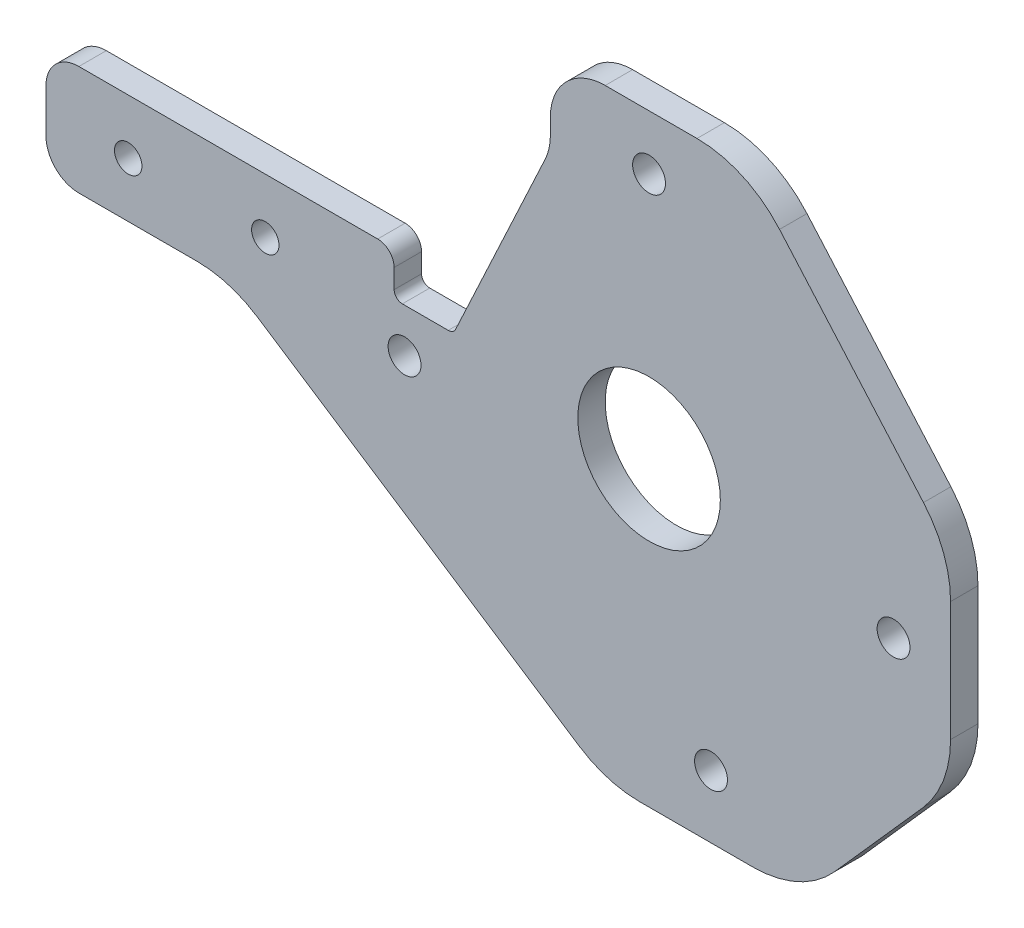
ISO-10303-21;
HEADER;
FILE_DESCRIPTION(('STEP AP214'),'2;1');
FILE_NAME('part.step','',(''),(''),'','','');
FILE_SCHEMA(('AUTOMOTIVE_DESIGN { 1 0 10303 214 1 1 1 1 }'));
ENDSEC;
DATA;
#1=APPLICATION_CONTEXT('core data for automotive mechanical design processes');
#2=APPLICATION_PROTOCOL_DEFINITION('international standard','automotive_design',2000,#1);
#3=PRODUCT_CONTEXT('',#1,'mechanical');
#4=PRODUCT('Part','Part','',(#3));
#5=PRODUCT_RELATED_PRODUCT_CATEGORY('part','',(#4));
#6=PRODUCT_DEFINITION_FORMATION('','',#4);
#7=PRODUCT_DEFINITION_CONTEXT('part definition',#1,'design');
#8=PRODUCT_DEFINITION('design','',#6,#7);
#9=PRODUCT_DEFINITION_SHAPE('','',#8);
#10=(LENGTH_UNIT() NAMED_UNIT(*) SI_UNIT(.MILLI.,.METRE.));
#11=(NAMED_UNIT(*) PLANE_ANGLE_UNIT() SI_UNIT($,.RADIAN.));
#12=(NAMED_UNIT(*) SI_UNIT($,.STERADIAN.) SOLID_ANGLE_UNIT());
#13=UNCERTAINTY_MEASURE_WITH_UNIT(LENGTH_MEASURE(1.E-05),#10,'distance_accuracy_value','');
#14=(GEOMETRIC_REPRESENTATION_CONTEXT(3) GLOBAL_UNCERTAINTY_ASSIGNED_CONTEXT((#13)) GLOBAL_UNIT_ASSIGNED_CONTEXT((#10,
#11,#12)) REPRESENTATION_CONTEXT('',''));
#15=CARTESIAN_POINT('',(0.,0.,0.));
#16=DIRECTION('',(0.,0.,1.));
#17=DIRECTION('',(1.,0.,0.));
#18=AXIS2_PLACEMENT_3D('',#15,#16,#17);
#19=CARTESIAN_POINT('',(0.,-10.,2.5));
#20=DIRECTION('',(0.,1.,0.));
#21=DIRECTION('',(0.,0.,1.));
#22=AXIS2_PLACEMENT_3D('',#19,#20,#21);
#23=PLANE('',#22);
#24=DIRECTION('',(1.,0.,0.));
#25=VECTOR('',#24,1.);
#26=CARTESIAN_POINT('',(0.,-10.,2.5));
#27=LINE('',#26,#25);
#28=CARTESIAN_POINT('',(-104.,-10.,2.5));
#29=VERTEX_POINT('',#28);
#30=CARTESIAN_POINT('',(-82.4582213056563,-10.,2.5));
#31=VERTEX_POINT('',#30);
#32=EDGE_CURVE('E301',#29,#31,#27,.T.);
#33=ORIENTED_EDGE('',*,*,#32,.F.);
#34=DIRECTION('',(0.,0.,-1.));
#35=VECTOR('',#34,1.);
#36=CARTESIAN_POINT('',(-104.,-10.,2.5));
#37=LINE('',#36,#35);
#38=CARTESIAN_POINT('',(-104.,-10.,-2.5));
#39=VERTEX_POINT('',#38);
#40=EDGE_CURVE('E407',#29,#39,#37,.T.);
#41=ORIENTED_EDGE('',*,*,#40,.T.);
#42=DIRECTION('',(1.,0.,0.));
#43=VECTOR('',#42,1.);
#44=CARTESIAN_POINT('',(0.,-10.,-2.5));
#45=LINE('',#44,#43);
#46=CARTESIAN_POINT('',(-82.4582213056563,-10.,-2.5));
#47=VERTEX_POINT('',#46);
#48=EDGE_CURVE('E334',#39,#47,#45,.T.);
#49=ORIENTED_EDGE('',*,*,#48,.T.);
#50=DIRECTION('',(0.,0.,-1.));
#51=VECTOR('',#50,1.);
#52=CARTESIAN_POINT('',(-82.4582213056563,-10.,2.5));
#53=LINE('',#52,#51);
#54=EDGE_CURVE('E344',#47,#31,#53,.F.);
#55=ORIENTED_EDGE('',*,*,#54,.T.);
#56=EDGE_LOOP('',(#33,#41,#49,#55));
#57=FACE_BOUND('',#56,.T.);
#58=ADVANCED_FACE('F43',(#57),#23,.F.);
#59=CARTESIAN_POINT('',(0.,10.,2.5));
#60=DIRECTION('',(0.,-1.,0.));
#61=DIRECTION('',(1.,0.,0.));
#62=AXIS2_PLACEMENT_3D('',#59,#60,#61);
#63=PLANE('',#62);
#64=DIRECTION('',(-1.,0.,0.));
#65=VECTOR('',#64,1.);
#66=CARTESIAN_POINT('',(0.,10.,2.5));
#67=LINE('',#66,#65);
#68=CARTESIAN_POINT('',(-49.5,10.,2.5));
#69=VERTEX_POINT('',#68);
#70=CARTESIAN_POINT('',(-104.,9.99999999999999,2.5));
#71=VERTEX_POINT('',#70);
#72=EDGE_CURVE('E296',#69,#71,#67,.T.);
#73=ORIENTED_EDGE('',*,*,#72,.F.);
#74=DIRECTION('',(0.,0.,1.));
#75=VECTOR('',#74,1.);
#76=CARTESIAN_POINT('',(-49.5,10.,2.5));
#77=LINE('',#76,#75);
#78=CARTESIAN_POINT('',(-49.5,10.,-2.5));
#79=VERTEX_POINT('',#78);
#80=EDGE_CURVE('E435',#69,#79,#77,.F.);
#81=ORIENTED_EDGE('',*,*,#80,.T.);
#82=DIRECTION('',(-1.,0.,0.));
#83=VECTOR('',#82,1.);
#84=CARTESIAN_POINT('',(0.,10.,-2.5));
#85=LINE('',#84,#83);
#86=CARTESIAN_POINT('',(-104.,9.99999999999999,-2.5));
#87=VERTEX_POINT('',#86);
#88=EDGE_CURVE('E329',#79,#87,#85,.T.);
#89=ORIENTED_EDGE('',*,*,#88,.T.);
#90=DIRECTION('',(0.,0.,-1.));
#91=VECTOR('',#90,1.);
#92=CARTESIAN_POINT('',(-104.,9.99999999999999,2.5));
#93=LINE('',#92,#91);
#94=EDGE_CURVE('E400',#87,#71,#93,.F.);
#95=ORIENTED_EDGE('',*,*,#94,.T.);
#96=EDGE_LOOP('',(#73,#81,#89,#95));
#97=FACE_BOUND('',#96,.T.);
#98=ADVANCED_FACE('F480',(#97),#63,.F.);
#99=CARTESIAN_POINT('',(-110.,0.,2.5));
#100=DIRECTION('',(1.,0.,0.));
#101=DIRECTION('',(0.,1.,0.));
#102=AXIS2_PLACEMENT_3D('',#99,#100,#101);
#103=PLANE('',#102);
#104=DIRECTION('',(0.,-1.,0.));
#105=VECTOR('',#104,1.);
#106=CARTESIAN_POINT('',(-110.,0.,2.5));
#107=LINE('',#106,#105);
#108=CARTESIAN_POINT('',(-110.,3.99999999999999,2.5));
#109=VERTEX_POINT('',#108);
#110=CARTESIAN_POINT('',(-110.,-4.00000000000001,2.5));
#111=VERTEX_POINT('',#110);
#112=EDGE_CURVE('E298',#109,#111,#107,.T.);
#113=ORIENTED_EDGE('',*,*,#112,.F.);
#114=DIRECTION('',(0.,0.,-1.));
#115=VECTOR('',#114,1.);
#116=CARTESIAN_POINT('',(-110.,3.99999999999999,2.5));
#117=LINE('',#116,#115);
#118=CARTESIAN_POINT('',(-110.,3.99999999999999,-2.5));
#119=VERTEX_POINT('',#118);
#120=EDGE_CURVE('E392',#109,#119,#117,.T.);
#121=ORIENTED_EDGE('',*,*,#120,.T.);
#122=DIRECTION('',(0.,-1.,0.));
#123=VECTOR('',#122,1.);
#124=CARTESIAN_POINT('',(-110.,0.,-2.5));
#125=LINE('',#124,#123);
#126=CARTESIAN_POINT('',(-110.,-4.00000000000001,-2.5));
#127=VERTEX_POINT('',#126);
#128=EDGE_CURVE('E331',#119,#127,#125,.T.);
#129=ORIENTED_EDGE('',*,*,#128,.T.);
#130=DIRECTION('',(0.,0.,-1.));
#131=VECTOR('',#130,1.);
#132=CARTESIAN_POINT('',(-110.,-4.00000000000001,2.5));
#133=LINE('',#132,#131);
#134=EDGE_CURVE('E390',#127,#111,#133,.F.);
#135=ORIENTED_EDGE('',*,*,#134,.T.);
#136=EDGE_LOOP('',(#113,#121,#129,#135));
#137=FACE_BOUND('',#136,.T.);
#138=ADVANCED_FACE('F489',(#137),#103,.F.);
#139=CARTESIAN_POINT('',(0.,-55.,2.5));
#140=DIRECTION('',(0.,1.,0.));
#141=DIRECTION('',(0.,0.,1.));
#142=AXIS2_PLACEMENT_3D('',#139,#140,#141);
#143=PLANE('',#142);
#144=DIRECTION('',(1.,0.,0.));
#145=VECTOR('',#144,1.);
#146=CARTESIAN_POINT('',(0.,-55.,2.5));
#147=LINE('',#146,#145);
#148=CARTESIAN_POINT('',(-1.77605476291935,-55.,2.5));
#149=VERTEX_POINT('',#148);
#150=CARTESIAN_POINT('',(18.8874431024964,-55.,2.5));
#151=VERTEX_POINT('',#150);
#152=EDGE_CURVE('E303',#149,#151,#147,.T.);
#153=ORIENTED_EDGE('',*,*,#152,.F.);
#154=DIRECTION('',(0.,0.,1.));
#155=VECTOR('',#154,1.);
#156=CARTESIAN_POINT('',(-1.77605476291935,-55.,2.5));
#157=LINE('',#156,#155);
#158=CARTESIAN_POINT('',(-1.77605476291935,-55.,-2.5));
#159=VERTEX_POINT('',#158);
#160=EDGE_CURVE('E221',#149,#159,#157,.F.);
#161=ORIENTED_EDGE('',*,*,#160,.T.);
#162=DIRECTION('',(1.,0.,0.));
#163=VECTOR('',#162,1.);
#164=CARTESIAN_POINT('',(0.,-55.,-2.5));
#165=LINE('',#164,#163);
#166=CARTESIAN_POINT('',(18.8874431024964,-55.,-2.5));
#167=VERTEX_POINT('',#166);
#168=EDGE_CURVE('E336',#159,#167,#165,.T.);
#169=ORIENTED_EDGE('',*,*,#168,.T.);
#170=DIRECTION('',(0.,0.,1.));
#171=VECTOR('',#170,1.);
#172=CARTESIAN_POINT('',(18.8874431024964,-55.,2.5));
#173=LINE('',#172,#171);
#174=EDGE_CURVE('E225',#167,#151,#173,.T.);
#175=ORIENTED_EDGE('',*,*,#174,.T.);
#176=EDGE_LOOP('',(#153,#161,#169,#175));
#177=FACE_BOUND('',#176,.T.);
#178=ADVANCED_FACE('F505',(#177),#143,.F.);
#179=CARTESIAN_POINT('',(55.,0.,2.5));
#180=DIRECTION('',(-1.,0.,0.));
#181=DIRECTION('',(0.,0.,1.));
#182=AXIS2_PLACEMENT_3D('',#179,#180,#181);
#183=PLANE('',#182);
#184=DIRECTION('',(0.,1.,0.));
#185=VECTOR('',#184,1.);
#186=CARTESIAN_POINT('',(55.,0.,2.5));
#187=LINE('',#186,#185);
#188=CARTESIAN_POINT('',(55.,-16.8261267667128,2.5));
#189=VERTEX_POINT('',#188);
#190=CARTESIAN_POINT('',(55.,4.97596875721935,2.5));
#191=VERTEX_POINT('',#190);
#192=EDGE_CURVE('E305',#189,#191,#187,.T.);
#193=ORIENTED_EDGE('',*,*,#192,.F.);
#194=DIRECTION('',(0.,0.,1.));
#195=VECTOR('',#194,1.);
#196=CARTESIAN_POINT('',(55.,-16.8261267667128,2.5));
#197=LINE('',#196,#195);
#198=CARTESIAN_POINT('',(55.,-16.8261267667128,-2.5));
#199=VERTEX_POINT('',#198);
#200=EDGE_CURVE('E376',#189,#199,#197,.F.);
#201=ORIENTED_EDGE('',*,*,#200,.T.);
#202=DIRECTION('',(0.,1.,0.));
#203=VECTOR('',#202,1.);
#204=CARTESIAN_POINT('',(55.,0.,-2.5));
#205=LINE('',#204,#203);
#206=CARTESIAN_POINT('',(55.,4.97596875721935,-2.5));
#207=VERTEX_POINT('',#206);
#208=EDGE_CURVE('E339',#199,#207,#205,.T.);
#209=ORIENTED_EDGE('',*,*,#208,.T.);
#210=DIRECTION('',(0.,0.,1.));
#211=VECTOR('',#210,1.);
#212=CARTESIAN_POINT('',(55.,4.97596875721935,2.5));
#213=LINE('',#212,#211);
#214=EDGE_CURVE('E373',#207,#191,#213,.T.);
#215=ORIENTED_EDGE('',*,*,#214,.T.);
#216=EDGE_LOOP('',(#193,#201,#209,#215));
#217=FACE_BOUND('',#216,.T.);
#218=ADVANCED_FACE('F534',(#217),#183,.F.);
#219=CARTESIAN_POINT('',(0.,44.9999999999999,2.5));
#220=DIRECTION('',(0.,0.,-1.));
#221=DIRECTION('',(-1.,0.,0.));
#222=AXIS2_PLACEMENT_3D('',#219,#220,#221);
#223=CYLINDRICAL_SURFACE('',#222,3.00000000000001);
#224=CARTESIAN_POINT('',(0.,44.9999999999999,2.5));
#225=DIRECTION('',(0.,0.,1.));
#226=DIRECTION('',(1.,0.,0.));
#227=AXIS2_PLACEMENT_3D('',#224,#225,#226);
#228=CIRCLE('',#227,3.00000000000001);
#229=CARTESIAN_POINT('',(3.00000000000001,44.9999999999999,2.5));
#230=VERTEX_POINT('',#229);
#231=EDGE_CURVE('E293',#230,#230,#228,.T.);
#232=ORIENTED_EDGE('',*,*,#231,.T.);
#233=EDGE_LOOP('',(#232));
#234=FACE_BOUND('',#233,.T.);
#235=CARTESIAN_POINT('',(0.,44.9999999999999,-2.5));
#236=DIRECTION('',(0.,0.,1.));
#237=DIRECTION('',(1.,0.,0.));
#238=AXIS2_PLACEMENT_3D('',#235,#236,#237);
#239=CIRCLE('',#238,3.00000000000001);
#240=CARTESIAN_POINT('',(3.00000000000001,44.9999999999999,-2.5));
#241=VERTEX_POINT('',#240);
#242=EDGE_CURVE('E326',#241,#241,#239,.T.);
#243=ORIENTED_EDGE('',*,*,#242,.F.);
#244=EDGE_LOOP('',(#243));
#245=FACE_BOUND('',#244,.T.);
#246=ADVANCED_FACE('F559',(#234,#245),#223,.F.);
#247=CARTESIAN_POINT('',(-44.5982062419555,-6.00000000000005,2.5));
#248=DIRECTION('',(0.,0.,-1.));
#249=DIRECTION('',(-1.,0.,0.));
#250=AXIS2_PLACEMENT_3D('',#247,#248,#249);
#251=CYLINDRICAL_SURFACE('',#250,2.99999999999999);
#252=CARTESIAN_POINT('',(-44.5982062419555,-6.00000000000005,2.5));
#253=DIRECTION('',(0.,0.,1.));
#254=DIRECTION('',(1.,0.,0.));
#255=AXIS2_PLACEMENT_3D('',#252,#253,#254);
#256=CIRCLE('',#255,2.99999999999999);
#257=CARTESIAN_POINT('',(-41.5982062419555,-6.00000000000005,2.5));
#258=VERTEX_POINT('',#257);
#259=EDGE_CURVE('E290',#258,#258,#256,.T.);
#260=ORIENTED_EDGE('',*,*,#259,.T.);
#261=EDGE_LOOP('',(#260));
#262=FACE_BOUND('',#261,.T.);
#263=CARTESIAN_POINT('',(-44.5982062419555,-6.00000000000005,-2.5));
#264=DIRECTION('',(0.,0.,1.));
#265=DIRECTION('',(1.,0.,0.));
#266=AXIS2_PLACEMENT_3D('',#263,#264,#265);
#267=CIRCLE('',#266,2.99999999999999);
#268=CARTESIAN_POINT('',(-41.5982062419555,-6.00000000000005,-2.5));
#269=VERTEX_POINT('',#268);
#270=EDGE_CURVE('E323',#269,#269,#267,.T.);
#271=ORIENTED_EDGE('',*,*,#270,.F.);
#272=EDGE_LOOP('',(#271));
#273=FACE_BOUND('',#272,.T.);
#274=ADVANCED_FACE('F562',(#262,#273),#251,.F.);
#275=CARTESIAN_POINT('',(44.5982062419555,-6.00000000000005,2.5));
#276=DIRECTION('',(0.,0.,-1.));
#277=DIRECTION('',(-1.,0.,0.));
#278=AXIS2_PLACEMENT_3D('',#275,#276,#277);
#279=CYLINDRICAL_SURFACE('',#278,3.);
#280=CARTESIAN_POINT('',(44.5982062419555,-6.00000000000005,2.5));
#281=DIRECTION('',(0.,0.,1.));
#282=DIRECTION('',(1.,0.,0.));
#283=AXIS2_PLACEMENT_3D('',#280,#281,#282);
#284=CIRCLE('',#283,3.);
#285=CARTESIAN_POINT('',(47.5982062419555,-6.00000000000005,2.5));
#286=VERTEX_POINT('',#285);
#287=EDGE_CURVE('E287',#286,#286,#284,.T.);
#288=ORIENTED_EDGE('',*,*,#287,.T.);
#289=EDGE_LOOP('',(#288));
#290=FACE_BOUND('',#289,.T.);
#291=CARTESIAN_POINT('',(44.5982062419555,-6.00000000000005,-2.5));
#292=DIRECTION('',(0.,0.,1.));
#293=DIRECTION('',(1.,0.,0.));
#294=AXIS2_PLACEMENT_3D('',#291,#292,#293);
#295=CIRCLE('',#294,3.);
#296=CARTESIAN_POINT('',(47.5982062419555,-6.00000000000005,-2.5));
#297=VERTEX_POINT('',#296);
#298=EDGE_CURVE('E320',#297,#297,#295,.T.);
#299=ORIENTED_EDGE('',*,*,#298,.F.);
#300=EDGE_LOOP('',(#299));
#301=FACE_BOUND('',#300,.T.);
#302=ADVANCED_FACE('F566',(#290,#301),#279,.F.);
#303=CARTESIAN_POINT('',(11.3,-43.5581220899157,2.5));
#304=DIRECTION('',(0.,0.,-1.));
#305=DIRECTION('',(-1.,0.,0.));
#306=AXIS2_PLACEMENT_3D('',#303,#304,#305);
#307=CYLINDRICAL_SURFACE('',#306,3.00000000000001);
#308=CARTESIAN_POINT('',(11.3,-43.5581220899157,2.5));
#309=DIRECTION('',(0.,0.,1.));
#310=DIRECTION('',(1.,0.,0.));
#311=AXIS2_PLACEMENT_3D('',#308,#309,#310);
#312=CIRCLE('',#311,3.00000000000001);
#313=CARTESIAN_POINT('',(14.3,-43.5581220899157,2.5));
#314=VERTEX_POINT('',#313);
#315=EDGE_CURVE('E284',#314,#314,#312,.T.);
#316=ORIENTED_EDGE('',*,*,#315,.T.);
#317=EDGE_LOOP('',(#316));
#318=FACE_BOUND('',#317,.T.);
#319=CARTESIAN_POINT('',(11.3,-43.5581220899157,-2.5));
#320=DIRECTION('',(0.,0.,1.));
#321=DIRECTION('',(1.,0.,0.));
#322=AXIS2_PLACEMENT_3D('',#319,#320,#321);
#323=CIRCLE('',#322,3.00000000000001);
#324=CARTESIAN_POINT('',(14.3,-43.5581220899157,-2.5));
#325=VERTEX_POINT('',#324);
#326=EDGE_CURVE('E317',#325,#325,#323,.T.);
#327=ORIENTED_EDGE('',*,*,#326,.F.);
#328=EDGE_LOOP('',(#327));
#329=FACE_BOUND('',#328,.T.);
#330=ADVANCED_FACE('F570',(#318,#329),#307,.F.);
#331=CARTESIAN_POINT('',(0.,0.,2.5));
#332=DIRECTION('',(0.,0.,-1.));
#333=DIRECTION('',(-1.,0.,0.));
#334=AXIS2_PLACEMENT_3D('',#331,#332,#333);
#335=CYLINDRICAL_SURFACE('',#334,13.);
#336=CARTESIAN_POINT('',(0.,0.,2.5));
#337=DIRECTION('',(0.,0.,1.));
#338=DIRECTION('',(1.,0.,0.));
#339=AXIS2_PLACEMENT_3D('',#336,#337,#338);
#340=CIRCLE('',#339,13.);
#341=CARTESIAN_POINT('',(13.,0.,2.5));
#342=VERTEX_POINT('',#341);
#343=EDGE_CURVE('E281',#342,#342,#340,.T.);
#344=ORIENTED_EDGE('',*,*,#343,.T.);
#345=EDGE_LOOP('',(#344));
#346=FACE_BOUND('',#345,.T.);
#347=CARTESIAN_POINT('',(0.,0.,-2.5));
#348=DIRECTION('',(0.,0.,1.));
#349=DIRECTION('',(1.,0.,0.));
#350=AXIS2_PLACEMENT_3D('',#347,#348,#349);
#351=CIRCLE('',#350,13.);
#352=CARTESIAN_POINT('',(13.,0.,-2.5));
#353=VERTEX_POINT('',#352);
#354=EDGE_CURVE('E314',#353,#353,#351,.T.);
#355=ORIENTED_EDGE('',*,*,#354,.F.);
#356=EDGE_LOOP('',(#355));
#357=FACE_BOUND('',#356,.T.);
#358=ADVANCED_FACE('F574',(#346,#357),#335,.F.);
#359=CARTESIAN_POINT('',(-95.,0.,2.5));
#360=DIRECTION('',(0.,0.,-1.));
#361=DIRECTION('',(-1.,0.,0.));
#362=AXIS2_PLACEMENT_3D('',#359,#360,#361);
#363=CYLINDRICAL_SURFACE('',#362,2.50000000000001);
#364=CARTESIAN_POINT('',(-95.,0.,2.5));
#365=DIRECTION('',(0.,0.,1.));
#366=DIRECTION('',(1.,0.,0.));
#367=AXIS2_PLACEMENT_3D('',#364,#365,#366);
#368=CIRCLE('',#367,2.50000000000001);
#369=CARTESIAN_POINT('',(-92.5,0.,2.5));
#370=VERTEX_POINT('',#369);
#371=EDGE_CURVE('E277',#370,#370,#368,.T.);
#372=ORIENTED_EDGE('',*,*,#371,.T.);
#373=EDGE_LOOP('',(#372));
#374=FACE_BOUND('',#373,.T.);
#375=CARTESIAN_POINT('',(-95.,0.,-2.5));
#376=DIRECTION('',(0.,0.,1.));
#377=DIRECTION('',(1.,0.,0.));
#378=AXIS2_PLACEMENT_3D('',#375,#376,#377);
#379=CIRCLE('',#378,2.50000000000001);
#380=CARTESIAN_POINT('',(-92.5,0.,-2.5));
#381=VERTEX_POINT('',#380);
#382=EDGE_CURVE('E311',#381,#381,#379,.T.);
#383=ORIENTED_EDGE('',*,*,#382,.F.);
#384=EDGE_LOOP('',(#383));
#385=FACE_BOUND('',#384,.T.);
#386=ADVANCED_FACE('F578',(#374,#385),#363,.F.);
#387=CARTESIAN_POINT('',(-70.,0.,2.5));
#388=DIRECTION('',(0.,0.,-1.));
#389=DIRECTION('',(-1.,0.,0.));
#390=AXIS2_PLACEMENT_3D('',#387,#388,#389);
#391=CYLINDRICAL_SURFACE('',#390,2.5);
#392=CARTESIAN_POINT('',(-70.,0.,2.5));
#393=DIRECTION('',(0.,0.,1.));
#394=DIRECTION('',(1.,0.,0.));
#395=AXIS2_PLACEMENT_3D('',#392,#393,#394);
#396=CIRCLE('',#395,2.5);
#397=CARTESIAN_POINT('',(-67.5,0.,2.5));
#398=VERTEX_POINT('',#397);
#399=EDGE_CURVE('E274',#398,#398,#396,.T.);
#400=ORIENTED_EDGE('',*,*,#399,.T.);
#401=EDGE_LOOP('',(#400));
#402=FACE_BOUND('',#401,.T.);
#403=CARTESIAN_POINT('',(-70.,0.,-2.5));
#404=DIRECTION('',(0.,0.,1.));
#405=DIRECTION('',(1.,0.,0.));
#406=AXIS2_PLACEMENT_3D('',#403,#404,#405);
#407=CIRCLE('',#406,2.5);
#408=CARTESIAN_POINT('',(-67.5,0.,-2.5));
#409=VERTEX_POINT('',#408);
#410=EDGE_CURVE('E273',#409,#409,#407,.T.);
#411=ORIENTED_EDGE('',*,*,#410,.F.);
#412=EDGE_LOOP('',(#411));
#413=FACE_BOUND('',#412,.T.);
#414=ADVANCED_FACE('F582',(#402,#413),#391,.F.);
#415=CARTESIAN_POINT('',(0.,55.,2.5));
#416=DIRECTION('',(0.,1.,0.));
#417=DIRECTION('',(-1.,0.,0.));
#418=AXIS2_PLACEMENT_3D('',#415,#416,#417);
#419=PLANE('',#418);
#420=DIRECTION('',(1.,0.,0.));
#421=VECTOR('',#420,1.);
#422=CARTESIAN_POINT('',(0.,55.,-2.5));
#423=LINE('',#422,#421);
#424=CARTESIAN_POINT('',(-8.,55.,-2.5));
#425=VERTEX_POINT('',#424);
#426=CARTESIAN_POINT('',(8.74474632195203,55.,-2.5));
#427=VERTEX_POINT('',#426);
#428=EDGE_CURVE('E278',#425,#427,#423,.T.);
#429=ORIENTED_EDGE('',*,*,#428,.F.);
#430=DIRECTION('',(0.,0.,1.));
#431=VECTOR('',#430,1.);
#432=CARTESIAN_POINT('',(-8.,55.,2.5));
#433=LINE('',#432,#431);
#434=CARTESIAN_POINT('',(-8.,55.,2.5));
#435=VERTEX_POINT('',#434);
#436=EDGE_CURVE('E418',#425,#435,#433,.T.);
#437=ORIENTED_EDGE('',*,*,#436,.T.);
#438=DIRECTION('',(1.,0.,0.));
#439=VECTOR('',#438,1.);
#440=CARTESIAN_POINT('',(0.,55.,2.5));
#441=LINE('',#440,#439);
#442=CARTESIAN_POINT('',(8.74474632195203,55.,2.5));
#443=VERTEX_POINT('',#442);
#444=EDGE_CURVE('E238',#435,#443,#441,.T.);
#445=ORIENTED_EDGE('',*,*,#444,.T.);
#446=DIRECTION('',(0.,0.,1.));
#447=VECTOR('',#446,1.);
#448=CARTESIAN_POINT('',(8.74474632195203,55.,-2.5));
#449=LINE('',#448,#447);
#450=EDGE_CURVE('E383',#443,#427,#449,.F.);
#451=ORIENTED_EDGE('',*,*,#450,.T.);
#452=EDGE_LOOP('',(#429,#437,#445,#451));
#453=FACE_BOUND('',#452,.T.);
#454=ADVANCED_FACE('F586',(#453),#419,.T.);
#455=CARTESIAN_POINT('',(0.,0.,2.5));
#456=DIRECTION('',(0.,0.,1.));
#457=DIRECTION('',(1.,0.,0.));
#458=AXIS2_PLACEMENT_3D('',#455,#456,#457);
#459=PLANE('',#458);
#460=DIRECTION('',(0.,-1.,0.));
#461=VECTOR('',#460,1.);
#462=CARTESIAN_POINT('',(-46.5,10.,2.5));
#463=LINE('',#462,#461);
#464=CARTESIAN_POINT('',(-46.5,7.,2.5));
#465=VERTEX_POINT('',#464);
#466=CARTESIAN_POINT('',(-46.5,3.5,2.5));
#467=VERTEX_POINT('',#466);
#468=EDGE_CURVE('E252',#465,#467,#463,.T.);
#469=ORIENTED_EDGE('',*,*,#468,.F.);
#470=CARTESIAN_POINT('',(-49.5,7.,2.5));
#471=DIRECTION('',(0.,0.,1.));
#472=DIRECTION('',(1.,0.,0.));
#473=AXIS2_PLACEMENT_3D('',#470,#471,#472);
#474=CIRCLE('',#473,3.);
#475=EDGE_CURVE('E433',#465,#69,#474,.T.);
#476=ORIENTED_EDGE('',*,*,#475,.T.);
#477=ORIENTED_EDGE('',*,*,#72,.T.);
#478=CARTESIAN_POINT('',(-104.,3.99999999999999,2.5));
#479=DIRECTION('',(0.,0.,1.));
#480=DIRECTION('',(1.,0.,0.));
#481=AXIS2_PLACEMENT_3D('',#478,#479,#480);
#482=CIRCLE('',#481,6.);
#483=EDGE_CURVE('E405',#71,#109,#482,.T.);
#484=ORIENTED_EDGE('',*,*,#483,.T.);
#485=ORIENTED_EDGE('',*,*,#112,.T.);
#486=CARTESIAN_POINT('',(-104.,-4.00000000000002,2.5));
#487=DIRECTION('',(0.,0.,1.));
#488=DIRECTION('',(1.,0.,0.));
#489=AXIS2_PLACEMENT_3D('',#486,#487,#488);
#490=CIRCLE('',#489,6.);
#491=EDGE_CURVE('E403',#111,#29,#490,.T.);
#492=ORIENTED_EDGE('',*,*,#491,.T.);
#493=ORIENTED_EDGE('',*,*,#32,.T.);
#494=CARTESIAN_POINT('',(-82.4582213056563,-30.,2.5));
#495=DIRECTION('',(0.,0.,1.));
#496=DIRECTION('',(1.,0.,0.));
#497=AXIS2_PLACEMENT_3D('',#494,#495,#496);
#498=CIRCLE('',#497,20.);
#499=CARTESIAN_POINT('',(-71.5057098778198,-13.2655297836139,2.5));
#500=VERTEX_POINT('',#499);
#501=EDGE_CURVE('E243',#31,#500,#498,.F.);
#502=ORIENTED_EDGE('',*,*,#501,.T.);
#503=DIRECTION('',(-0.836723510819302,0.547625571391823,0.));
#504=VECTOR('',#503,1.);
#505=CARTESIAN_POINT('',(-7.73912506899439,-55.,2.5));
#506=LINE('',#505,#504);
#507=CARTESIAN_POINT('',(-12.7285661907558,-51.7344702163861,2.5));
#508=VERTEX_POINT('',#507);
#509=EDGE_CURVE('E233',#508,#500,#506,.T.);
#510=ORIENTED_EDGE('',*,*,#509,.F.);
#511=CARTESIAN_POINT('',(-1.77605476291935,-35.,2.5));
#512=DIRECTION('',(0.,0.,1.));
#513=DIRECTION('',(1.,0.,0.));
#514=AXIS2_PLACEMENT_3D('',#511,#512,#513);
#515=CIRCLE('',#514,20.);
#516=EDGE_CURVE('E216',#508,#149,#515,.T.);
#517=ORIENTED_EDGE('',*,*,#516,.T.);
#518=ORIENTED_EDGE('',*,*,#152,.T.);
#519=CARTESIAN_POINT('',(18.8874431024964,-35.,2.5));
#520=DIRECTION('',(0.,0.,1.));
#521=DIRECTION('',(1.,0.,0.));
#522=AXIS2_PLACEMENT_3D('',#519,#520,#521);
#523=CIRCLE('',#522,20.);
#524=CARTESIAN_POINT('',(33.8527890740685,-48.2679470887983,2.5));
#525=VERTEX_POINT('',#524);
#526=EDGE_CURVE('E226',#151,#525,#523,.T.);
#527=ORIENTED_EDGE('',*,*,#526,.T.);
#528=DIRECTION('',(-0.663397354439913,-0.748267298578606,0.));
#529=VECTOR('',#528,1.);
#530=CARTESIAN_POINT('',(55.,-24.4153249972039,2.5));
#531=LINE('',#530,#529);
#532=CARTESIAN_POINT('',(49.9653459715721,-30.094073855511,2.5));
#533=VERTEX_POINT('',#532);
#534=EDGE_CURVE('E247',#533,#525,#531,.T.);
#535=ORIENTED_EDGE('',*,*,#534,.F.);
#536=CARTESIAN_POINT('',(35.,-16.8261267667128,2.5));
#537=DIRECTION('',(0.,0.,1.));
#538=DIRECTION('',(1.,0.,0.));
#539=AXIS2_PLACEMENT_3D('',#536,#537,#538);
#540=CIRCLE('',#539,20.);
#541=EDGE_CURVE('E352',#533,#189,#540,.T.);
#542=ORIENTED_EDGE('',*,*,#541,.T.);
#543=ORIENTED_EDGE('',*,*,#192,.T.);
#544=CARTESIAN_POINT('',(35.,4.97596875721935,2.5));
#545=DIRECTION('',(0.,0.,1.));
#546=DIRECTION('',(1.,0.,0.));
#547=AXIS2_PLACEMENT_3D('',#544,#545,#546);
#548=CIRCLE('',#547,20.);
#549=CARTESIAN_POINT('',(50.0554530541816,18.141580529307,2.5));
#550=VERTEX_POINT('',#549);
#551=EDGE_CURVE('E350',#191,#550,#548,.T.);
#552=ORIENTED_EDGE('',*,*,#551,.T.);
#553=DIRECTION('',(0.658280588604383,-0.752772652709081,0.));
#554=VECTOR('',#553,1.);
#555=CARTESIAN_POINT('',(17.8237002442508,55.,2.5));
#556=LINE('',#555,#554);
#557=CARTESIAN_POINT('',(23.8001993761337,48.1656117720876,2.5));
#558=VERTEX_POINT('',#557);
#559=EDGE_CURVE('E255',#558,#550,#556,.T.);
#560=ORIENTED_EDGE('',*,*,#559,.F.);
#561=CARTESIAN_POINT('',(8.74474632195203,35.,2.5));
#562=DIRECTION('',(0.,0.,1.));
#563=DIRECTION('',(1.,0.,0.));
#564=AXIS2_PLACEMENT_3D('',#561,#562,#563);
#565=CIRCLE('',#564,20.);
#566=EDGE_CURVE('E347',#558,#443,#565,.T.);
#567=ORIENTED_EDGE('',*,*,#566,.T.);
#568=ORIENTED_EDGE('',*,*,#444,.F.);
#569=CARTESIAN_POINT('',(-8.,45.,2.5));
#570=DIRECTION('',(0.,0.,1.));
#571=DIRECTION('',(1.,0.,0.));
#572=AXIS2_PLACEMENT_3D('',#569,#570,#571);
#573=CIRCLE('',#572,10.);
#574=CARTESIAN_POINT('',(-18.,45.,2.5));
#575=VERTEX_POINT('',#574);
#576=EDGE_CURVE('E421',#435,#575,#573,.T.);
#577=ORIENTED_EDGE('',*,*,#576,.T.);
#578=DIRECTION('',(0.,1.,0.));
#579=VECTOR('',#578,1.);
#580=CARTESIAN_POINT('',(-18.,55.,2.5));
#581=LINE('',#580,#579);
#582=CARTESIAN_POINT('',(-18.,42.1224905017404,2.5));
#583=VERTEX_POINT('',#582);
#584=EDGE_CURVE('E260',#583,#575,#581,.T.);
#585=ORIENTED_EDGE('',*,*,#584,.F.);
#586=CARTESIAN_POINT('',(-28.,42.1224905017404,2.5));
#587=DIRECTION('',(0.,0.,1.));
#588=DIRECTION('',(1.,0.,0.));
#589=AXIS2_PLACEMENT_3D('',#586,#587,#588);
#590=CIRCLE('',#589,10.);
#591=CARTESIAN_POINT('',(-18.9369221296335,37.8963078843334,2.5));
#592=VERTEX_POINT('',#591);
#593=EDGE_CURVE('E425',#583,#592,#590,.F.);
#594=ORIENTED_EDGE('',*,*,#593,.T.);
#595=DIRECTION('',(0.422618261740697,0.906307787036651,0.));
#596=VECTOR('',#595,1.);
#597=CARTESIAN_POINT('',(-18.,39.905543875311,2.5));
#598=LINE('',#597,#596);
#599=CARTESIAN_POINT('',(-35.271789106244,2.86607260738896,2.5));
#600=VERTEX_POINT('',#599);
#601=EDGE_CURVE('E258',#600,#592,#598,.T.);
#602=ORIENTED_EDGE('',*,*,#601,.F.);
#603=CARTESIAN_POINT('',(-36.6312507867989,3.5,2.5));
#604=DIRECTION('',(0.,0.,1.));
#605=DIRECTION('',(1.,0.,0.));
#606=AXIS2_PLACEMENT_3D('',#603,#604,#605);
#607=CIRCLE('',#606,1.5);
#608=CARTESIAN_POINT('',(-36.6312507867989,2.,2.5));
#609=VERTEX_POINT('',#608);
#610=EDGE_CURVE('E448',#600,#609,#607,.F.);
#611=ORIENTED_EDGE('',*,*,#610,.T.);
#612=DIRECTION('',(1.,0.,0.));
#613=VECTOR('',#612,1.);
#614=CARTESIAN_POINT('',(-35.6756453955877,2.,2.5));
#615=LINE('',#614,#613);
#616=CARTESIAN_POINT('',(-45.,2.,2.5));
#617=VERTEX_POINT('',#616);
#618=EDGE_CURVE('E254',#617,#609,#615,.T.);
#619=ORIENTED_EDGE('',*,*,#618,.F.);
#620=CARTESIAN_POINT('',(-45.,3.5,2.5));
#621=DIRECTION('',(0.,0.,1.));
#622=DIRECTION('',(1.,0.,0.));
#623=AXIS2_PLACEMENT_3D('',#620,#621,#622);
#624=CIRCLE('',#623,1.5);
#625=EDGE_CURVE('E51',#617,#467,#624,.F.);
#626=ORIENTED_EDGE('',*,*,#625,.T.);
#627=EDGE_LOOP('',(#469,#476,#477,#484,#485,#492,#493,#502,#510,#517,#518,#527,#535,#542,#543,
#552,#560,#567,#568,#577,#585,#594,#602,#611,#619,#626));
#628=FACE_BOUND('',#627,.T.);
#629=ORIENTED_EDGE('',*,*,#399,.F.);
#630=EDGE_LOOP('',(#629));
#631=FACE_BOUND('',#630,.T.);
#632=ORIENTED_EDGE('',*,*,#371,.F.);
#633=EDGE_LOOP('',(#632));
#634=FACE_BOUND('',#633,.T.);
#635=ORIENTED_EDGE('',*,*,#343,.F.);
#636=EDGE_LOOP('',(#635));
#637=FACE_BOUND('',#636,.T.);
#638=ORIENTED_EDGE('',*,*,#315,.F.);
#639=EDGE_LOOP('',(#638));
#640=FACE_BOUND('',#639,.T.);
#641=ORIENTED_EDGE('',*,*,#287,.F.);
#642=EDGE_LOOP('',(#641));
#643=FACE_BOUND('',#642,.T.);
#644=ORIENTED_EDGE('',*,*,#259,.F.);
#645=EDGE_LOOP('',(#644));
#646=FACE_BOUND('',#645,.T.);
#647=ORIENTED_EDGE('',*,*,#231,.F.);
#648=EDGE_LOOP('',(#647));
#649=FACE_BOUND('',#648,.T.);
#650=ADVANCED_FACE('F240',(#628,#631,#634,#637,#640,#643,#646,#649),#459,.T.);
#651=CARTESIAN_POINT('',(0.,0.,-2.5));
#652=DIRECTION('',(0.,0.,1.));
#653=DIRECTION('',(1.,0.,0.));
#654=AXIS2_PLACEMENT_3D('',#651,#652,#653);
#655=PLANE('',#654);
#656=ORIENTED_EDGE('',*,*,#88,.F.);
#657=CARTESIAN_POINT('',(-49.5,7.,-2.5));
#658=DIRECTION('',(0.,0.,1.));
#659=DIRECTION('',(1.,0.,0.));
#660=AXIS2_PLACEMENT_3D('',#657,#658,#659);
#661=CIRCLE('',#660,3.);
#662=CARTESIAN_POINT('',(-46.5,7.,-2.5));
#663=VERTEX_POINT('',#662);
#664=EDGE_CURVE('E437',#79,#663,#661,.F.);
#665=ORIENTED_EDGE('',*,*,#664,.T.);
#666=DIRECTION('',(0.,-1.,0.));
#667=VECTOR('',#666,1.);
#668=CARTESIAN_POINT('',(-46.5,10.,-2.5));
#669=LINE('',#668,#667);
#670=CARTESIAN_POINT('',(-46.5,3.5,-2.5));
#671=VERTEX_POINT('',#670);
#672=EDGE_CURVE('E263',#663,#671,#669,.T.);
#673=ORIENTED_EDGE('',*,*,#672,.T.);
#674=CARTESIAN_POINT('',(-45.,3.5,-2.5));
#675=DIRECTION('',(0.,0.,1.));
#676=DIRECTION('',(1.,0.,0.));
#677=AXIS2_PLACEMENT_3D('',#674,#675,#676);
#678=CIRCLE('',#677,1.5);
#679=CARTESIAN_POINT('',(-45.,2.,-2.5));
#680=VERTEX_POINT('',#679);
#681=EDGE_CURVE('E11',#671,#680,#678,.T.);
#682=ORIENTED_EDGE('',*,*,#681,.T.);
#683=DIRECTION('',(1.,0.,0.));
#684=VECTOR('',#683,1.);
#685=CARTESIAN_POINT('',(-35.6756453955877,2.,-2.5));
#686=LINE('',#685,#684);
#687=CARTESIAN_POINT('',(-36.6312507867989,2.,-2.5));
#688=VERTEX_POINT('',#687);
#689=EDGE_CURVE('E265',#680,#688,#686,.T.);
#690=ORIENTED_EDGE('',*,*,#689,.T.);
#691=CARTESIAN_POINT('',(-36.6312507867989,3.5,-2.5));
#692=DIRECTION('',(0.,0.,1.));
#693=DIRECTION('',(1.,0.,0.));
#694=AXIS2_PLACEMENT_3D('',#691,#692,#693);
#695=CIRCLE('',#694,1.5);
#696=CARTESIAN_POINT('',(-35.271789106244,2.86607260738896,-2.5));
#697=VERTEX_POINT('',#696);
#698=EDGE_CURVE('E450',#688,#697,#695,.T.);
#699=ORIENTED_EDGE('',*,*,#698,.T.);
#700=DIRECTION('',(0.422618261740697,0.906307787036651,0.));
#701=VECTOR('',#700,1.);
#702=CARTESIAN_POINT('',(-18.,39.905543875311,-2.5));
#703=LINE('',#702,#701);
#704=CARTESIAN_POINT('',(-18.9369221296335,37.8963078843334,-2.5));
#705=VERTEX_POINT('',#704);
#706=EDGE_CURVE('E268',#697,#705,#703,.T.);
#707=ORIENTED_EDGE('',*,*,#706,.T.);
#708=CARTESIAN_POINT('',(-28.,42.1224905017404,-2.5));
#709=DIRECTION('',(0.,0.,1.));
#710=DIRECTION('',(1.,0.,0.));
#711=AXIS2_PLACEMENT_3D('',#708,#709,#710);
#712=CIRCLE('',#711,10.);
#713=CARTESIAN_POINT('',(-18.,42.1224905017404,-2.5));
#714=VERTEX_POINT('',#713);
#715=EDGE_CURVE('E428',#705,#714,#712,.T.);
#716=ORIENTED_EDGE('',*,*,#715,.T.);
#717=DIRECTION('',(0.,1.,0.));
#718=VECTOR('',#717,1.);
#719=CARTESIAN_POINT('',(-18.,55.,-2.5));
#720=LINE('',#719,#718);
#721=CARTESIAN_POINT('',(-18.,45.,-2.5));
#722=VERTEX_POINT('',#721);
#723=EDGE_CURVE('E270',#714,#722,#720,.T.);
#724=ORIENTED_EDGE('',*,*,#723,.T.);
#725=CARTESIAN_POINT('',(-8.,45.,-2.5));
#726=DIRECTION('',(0.,0.,1.));
#727=DIRECTION('',(1.,0.,0.));
#728=AXIS2_PLACEMENT_3D('',#725,#726,#727);
#729=CIRCLE('',#728,10.);
#730=EDGE_CURVE('E423',#722,#425,#729,.F.);
#731=ORIENTED_EDGE('',*,*,#730,.T.);
#732=ORIENTED_EDGE('',*,*,#428,.T.);
#733=CARTESIAN_POINT('',(8.74474632195203,35.,-2.5));
#734=DIRECTION('',(0.,0.,1.));
#735=DIRECTION('',(1.,0.,0.));
#736=AXIS2_PLACEMENT_3D('',#733,#734,#735);
#737=CIRCLE('',#736,20.);
#738=CARTESIAN_POINT('',(23.8001993761337,48.1656117720876,-2.5));
#739=VERTEX_POINT('',#738);
#740=EDGE_CURVE('E358',#427,#739,#737,.F.);
#741=ORIENTED_EDGE('',*,*,#740,.T.);
#742=DIRECTION('',(0.658280588604383,-0.752772652709081,0.));
#743=VECTOR('',#742,1.);
#744=CARTESIAN_POINT('',(17.8237002442508,55.,-2.5));
#745=LINE('',#744,#743);
#746=CARTESIAN_POINT('',(50.0554530541816,18.141580529307,-2.5));
#747=VERTEX_POINT('',#746);
#748=EDGE_CURVE('E515',#739,#747,#745,.T.);
#749=ORIENTED_EDGE('',*,*,#748,.T.);
#750=CARTESIAN_POINT('',(35.,4.97596875721935,-2.5));
#751=DIRECTION('',(0.,0.,1.));
#752=DIRECTION('',(1.,0.,0.));
#753=AXIS2_PLACEMENT_3D('',#750,#751,#752);
#754=CIRCLE('',#753,20.);
#755=EDGE_CURVE('E360',#747,#207,#754,.F.);
#756=ORIENTED_EDGE('',*,*,#755,.T.);
#757=ORIENTED_EDGE('',*,*,#208,.F.);
#758=CARTESIAN_POINT('',(35.,-16.8261267667128,-2.5));
#759=DIRECTION('',(0.,0.,1.));
#760=DIRECTION('',(1.,0.,0.));
#761=AXIS2_PLACEMENT_3D('',#758,#759,#760);
#762=CIRCLE('',#761,20.);
#763=CARTESIAN_POINT('',(49.9653459715721,-30.094073855511,-2.5));
#764=VERTEX_POINT('',#763);
#765=EDGE_CURVE('E362',#199,#764,#762,.F.);
#766=ORIENTED_EDGE('',*,*,#765,.T.);
#767=DIRECTION('',(-0.663397354439913,-0.748267298578606,0.));
#768=VECTOR('',#767,1.);
#769=CARTESIAN_POINT('',(55.,-24.4153249972039,-2.5));
#770=LINE('',#769,#768);
#771=CARTESIAN_POINT('',(33.8527890740685,-48.2679470887983,-2.5));
#772=VERTEX_POINT('',#771);
#773=EDGE_CURVE('E244',#764,#772,#770,.T.);
#774=ORIENTED_EDGE('',*,*,#773,.T.);
#775=CARTESIAN_POINT('',(18.8874431024964,-35.,-2.5));
#776=DIRECTION('',(0.,0.,1.));
#777=DIRECTION('',(1.,0.,0.));
#778=AXIS2_PLACEMENT_3D('',#775,#776,#777);
#779=CIRCLE('',#778,20.);
#780=EDGE_CURVE('E364',#772,#167,#779,.F.);
#781=ORIENTED_EDGE('',*,*,#780,.T.);
#782=ORIENTED_EDGE('',*,*,#168,.F.);
#783=CARTESIAN_POINT('',(-1.77605476291935,-35.,-2.5));
#784=DIRECTION('',(0.,0.,1.));
#785=DIRECTION('',(1.,0.,0.));
#786=AXIS2_PLACEMENT_3D('',#783,#784,#785);
#787=CIRCLE('',#786,20.);
#788=CARTESIAN_POINT('',(-12.7285661907558,-51.7344702163861,-2.5));
#789=VERTEX_POINT('',#788);
#790=EDGE_CURVE('E366',#159,#789,#787,.F.);
#791=ORIENTED_EDGE('',*,*,#790,.T.);
#792=DIRECTION('',(-0.836723510819302,0.547625571391823,0.));
#793=VECTOR('',#792,1.);
#794=CARTESIAN_POINT('',(-7.73912506899439,-55.,-2.5));
#795=LINE('',#794,#793);
#796=CARTESIAN_POINT('',(-71.5057098778198,-13.2655297836139,-2.5));
#797=VERTEX_POINT('',#796);
#798=EDGE_CURVE('E236',#789,#797,#795,.T.);
#799=ORIENTED_EDGE('',*,*,#798,.T.);
#800=CARTESIAN_POINT('',(-82.4582213056563,-30.,-2.5));
#801=DIRECTION('',(0.,0.,1.));
#802=DIRECTION('',(1.,0.,0.));
#803=AXIS2_PLACEMENT_3D('',#800,#801,#802);
#804=CIRCLE('',#803,20.);
#805=EDGE_CURVE('E386',#797,#47,#804,.T.);
#806=ORIENTED_EDGE('',*,*,#805,.T.);
#807=ORIENTED_EDGE('',*,*,#48,.F.);
#808=CARTESIAN_POINT('',(-104.,-4.00000000000002,-2.5));
#809=DIRECTION('',(0.,0.,1.));
#810=DIRECTION('',(1.,0.,0.));
#811=AXIS2_PLACEMENT_3D('',#808,#809,#810);
#812=CIRCLE('',#811,6.);
#813=EDGE_CURVE('E395',#39,#127,#812,.F.);
#814=ORIENTED_EDGE('',*,*,#813,.T.);
#815=ORIENTED_EDGE('',*,*,#128,.F.);
#816=CARTESIAN_POINT('',(-104.,3.99999999999999,-2.5));
#817=DIRECTION('',(0.,0.,1.));
#818=DIRECTION('',(1.,0.,0.));
#819=AXIS2_PLACEMENT_3D('',#816,#817,#818);
#820=CIRCLE('',#819,6.);
#821=EDGE_CURVE('E397',#119,#87,#820,.F.);
#822=ORIENTED_EDGE('',*,*,#821,.T.);
#823=EDGE_LOOP('',(#656,#665,#673,#682,#690,#699,#707,#716,#724,#731,#732,#741,#749,#756,#757,
#766,#774,#781,#782,#791,#799,#806,#807,#814,#815,#822));
#824=FACE_BOUND('',#823,.T.);
#825=ORIENTED_EDGE('',*,*,#410,.T.);
#826=EDGE_LOOP('',(#825));
#827=FACE_BOUND('',#826,.T.);
#828=ORIENTED_EDGE('',*,*,#382,.T.);
#829=EDGE_LOOP('',(#828));
#830=FACE_BOUND('',#829,.T.);
#831=ORIENTED_EDGE('',*,*,#354,.T.);
#832=EDGE_LOOP('',(#831));
#833=FACE_BOUND('',#832,.T.);
#834=ORIENTED_EDGE('',*,*,#326,.T.);
#835=EDGE_LOOP('',(#834));
#836=FACE_BOUND('',#835,.T.);
#837=ORIENTED_EDGE('',*,*,#298,.T.);
#838=EDGE_LOOP('',(#837));
#839=FACE_BOUND('',#838,.T.);
#840=ORIENTED_EDGE('',*,*,#270,.T.);
#841=EDGE_LOOP('',(#840));
#842=FACE_BOUND('',#841,.T.);
#843=ORIENTED_EDGE('',*,*,#242,.T.);
#844=EDGE_LOOP('',(#843));
#845=FACE_BOUND('',#844,.T.);
#846=ADVANCED_FACE('F455',(#824,#827,#830,#833,#836,#839,#842,#845),#655,.F.);
#847=CARTESIAN_POINT('',(-18.,55.,-2.5));
#848=DIRECTION('',(1.,0.,0.));
#849=DIRECTION('',(0.,0.,-1.));
#850=AXIS2_PLACEMENT_3D('',#847,#848,#849);
#851=PLANE('',#850);
#852=ORIENTED_EDGE('',*,*,#723,.F.);
#853=DIRECTION('',(0.,0.,1.));
#854=VECTOR('',#853,1.);
#855=CARTESIAN_POINT('',(-18.,42.1224905017404,2.5));
#856=LINE('',#855,#854);
#857=EDGE_CURVE('E412',#714,#583,#856,.T.);
#858=ORIENTED_EDGE('',*,*,#857,.T.);
#859=ORIENTED_EDGE('',*,*,#584,.T.);
#860=DIRECTION('',(0.,0.,1.));
#861=VECTOR('',#860,1.);
#862=CARTESIAN_POINT('',(-18.,45.,-2.5));
#863=LINE('',#862,#861);
#864=EDGE_CURVE('E410',#575,#722,#863,.F.);
#865=ORIENTED_EDGE('',*,*,#864,.T.);
#866=EDGE_LOOP('',(#852,#858,#859,#865));
#867=FACE_BOUND('',#866,.T.);
#868=ADVANCED_FACE('F703',(#867),#851,.F.);
#869=CARTESIAN_POINT('',(-18.,39.905543875311,-2.5));
#870=DIRECTION('',(0.906307787036651,-0.422618261740697,0.));
#871=DIRECTION('',(0.422618261740697,0.906307787036651,0.));
#872=AXIS2_PLACEMENT_3D('',#869,#870,#871);
#873=PLANE('',#872);
#874=ORIENTED_EDGE('',*,*,#706,.F.);
#875=DIRECTION('',(0.,0.,1.));
#876=VECTOR('',#875,1.);
#877=CARTESIAN_POINT('',(-35.271789106244,2.86607260738896,2.5));
#878=LINE('',#877,#876);
#879=EDGE_CURVE('E439',#697,#600,#878,.T.);
#880=ORIENTED_EDGE('',*,*,#879,.T.);
#881=ORIENTED_EDGE('',*,*,#601,.T.);
#882=DIRECTION('',(0.,0.,1.));
#883=VECTOR('',#882,1.);
#884=CARTESIAN_POINT('',(-18.9369221296335,37.8963078843334,-2.5));
#885=LINE('',#884,#883);
#886=EDGE_CURVE('E415',#592,#705,#885,.F.);
#887=ORIENTED_EDGE('',*,*,#886,.T.);
#888=EDGE_LOOP('',(#874,#880,#881,#887));
#889=FACE_BOUND('',#888,.T.);
#890=ADVANCED_FACE('F462',(#889),#873,.F.);
#891=CARTESIAN_POINT('',(-35.6756453955877,2.,-2.5));
#892=DIRECTION('',(0.,-1.,0.));
#893=DIRECTION('',(1.,0.,0.));
#894=AXIS2_PLACEMENT_3D('',#891,#892,#893);
#895=PLANE('',#894);
#896=ORIENTED_EDGE('',*,*,#618,.T.);
#897=DIRECTION('',(0.,0.,1.));
#898=VECTOR('',#897,1.);
#899=CARTESIAN_POINT('',(-36.6312507867989,2.,-2.5));
#900=LINE('',#899,#898);
#901=EDGE_CURVE('E445',#609,#688,#900,.F.);
#902=ORIENTED_EDGE('',*,*,#901,.T.);
#903=ORIENTED_EDGE('',*,*,#689,.F.);
#904=DIRECTION('',(0.,0.,1.));
#905=VECTOR('',#904,1.);
#906=CARTESIAN_POINT('',(-45.,2.,2.5));
#907=LINE('',#906,#905);
#908=EDGE_CURVE('E442',#680,#617,#907,.T.);
#909=ORIENTED_EDGE('',*,*,#908,.T.);
#910=EDGE_LOOP('',(#896,#902,#903,#909));
#911=FACE_BOUND('',#910,.T.);
#912=ADVANCED_FACE('F468',(#911),#895,.F.);
#913=CARTESIAN_POINT('',(-46.5,10.,-2.5));
#914=DIRECTION('',(-1.,0.,0.));
#915=DIRECTION('',(0.,0.,1.));
#916=AXIS2_PLACEMENT_3D('',#913,#914,#915);
#917=PLANE('',#916);
#918=ORIENTED_EDGE('',*,*,#468,.T.);
#919=DIRECTION('',(0.,0.,1.));
#920=VECTOR('',#919,1.);
#921=CARTESIAN_POINT('',(-46.5,3.5,-2.5));
#922=LINE('',#921,#920);
#923=EDGE_CURVE('E64',#467,#671,#922,.F.);
#924=ORIENTED_EDGE('',*,*,#923,.T.);
#925=ORIENTED_EDGE('',*,*,#672,.F.);
#926=DIRECTION('',(0.,0.,1.));
#927=VECTOR('',#926,1.);
#928=CARTESIAN_POINT('',(-46.5,7.,-2.5));
#929=LINE('',#928,#927);
#930=EDGE_CURVE('E430',#663,#465,#929,.T.);
#931=ORIENTED_EDGE('',*,*,#930,.T.);
#932=EDGE_LOOP('',(#918,#924,#925,#931));
#933=FACE_BOUND('',#932,.T.);
#934=ADVANCED_FACE('F474',(#933),#917,.F.);
#935=CARTESIAN_POINT('',(17.8237002442508,55.,-2.5));
#936=DIRECTION('',(-0.752772652709081,-0.658280588604383,0.));
#937=DIRECTION('',(0.658280588604383,-0.752772652709081,0.));
#938=AXIS2_PLACEMENT_3D('',#935,#936,#937);
#939=PLANE('',#938);
#940=ORIENTED_EDGE('',*,*,#559,.T.);
#941=DIRECTION('',(0.,0.,1.));
#942=VECTOR('',#941,1.);
#943=CARTESIAN_POINT('',(50.0554530541816,18.141580529307,-2.5));
#944=LINE('',#943,#942);
#945=EDGE_CURVE('E381',#550,#747,#944,.F.);
#946=ORIENTED_EDGE('',*,*,#945,.T.);
#947=ORIENTED_EDGE('',*,*,#748,.F.);
#948=DIRECTION('',(0.,0.,1.));
#949=VECTOR('',#948,1.);
#950=CARTESIAN_POINT('',(23.8001993761337,48.1656117720876,2.5));
#951=LINE('',#950,#949);
#952=EDGE_CURVE('E378',#739,#558,#951,.T.);
#953=ORIENTED_EDGE('',*,*,#952,.T.);
#954=EDGE_LOOP('',(#940,#946,#947,#953));
#955=FACE_BOUND('',#954,.T.);
#956=ADVANCED_FACE('F523',(#955),#939,.F.);
#957=CARTESIAN_POINT('',(55.,-24.4153249972039,-2.5));
#958=DIRECTION('',(-0.748267298578606,0.663397354439913,0.));
#959=DIRECTION('',(-0.663397354439913,-0.748267298578606,0.));
#960=AXIS2_PLACEMENT_3D('',#957,#958,#959);
#961=PLANE('',#960);
#962=ORIENTED_EDGE('',*,*,#534,.T.);
#963=DIRECTION('',(0.,0.,1.));
#964=VECTOR('',#963,1.);
#965=CARTESIAN_POINT('',(33.8527890740685,-48.2679470887983,-2.5));
#966=LINE('',#965,#964);
#967=EDGE_CURVE('E371',#525,#772,#966,.F.);
#968=ORIENTED_EDGE('',*,*,#967,.T.);
#969=ORIENTED_EDGE('',*,*,#773,.F.);
#970=DIRECTION('',(0.,0.,1.));
#971=VECTOR('',#970,1.);
#972=CARTESIAN_POINT('',(49.9653459715721,-30.094073855511,-2.5));
#973=LINE('',#972,#971);
#974=EDGE_CURVE('E368',#764,#533,#973,.T.);
#975=ORIENTED_EDGE('',*,*,#974,.T.);
#976=EDGE_LOOP('',(#962,#968,#969,#975));
#977=FACE_BOUND('',#976,.T.);
#978=ADVANCED_FACE('F512',(#977),#961,.F.);
#979=CARTESIAN_POINT('',(-7.73912506899439,-55.,-2.5));
#980=DIRECTION('',(0.547625571391823,0.836723510819303,0.));
#981=DIRECTION('',(-0.836723510819303,0.547625571391823,0.));
#982=AXIS2_PLACEMENT_3D('',#979,#980,#981);
#983=PLANE('',#982);
#984=ORIENTED_EDGE('',*,*,#509,.T.);
#985=DIRECTION('',(0.,0.,-1.));
#986=VECTOR('',#985,1.);
#987=CARTESIAN_POINT('',(-71.5057098778198,-13.265529783614,-2.5));
#988=LINE('',#987,#986);
#989=EDGE_CURVE('E237',#500,#797,#988,.T.);
#990=ORIENTED_EDGE('',*,*,#989,.T.);
#991=ORIENTED_EDGE('',*,*,#798,.F.);
#992=DIRECTION('',(0.,0.,1.));
#993=VECTOR('',#992,1.);
#994=CARTESIAN_POINT('',(-12.7285661907558,-51.7344702163861,-2.5));
#995=LINE('',#994,#993);
#996=EDGE_CURVE('E220',#789,#508,#995,.T.);
#997=ORIENTED_EDGE('',*,*,#996,.T.);
#998=EDGE_LOOP('',(#984,#990,#991,#997));
#999=FACE_BOUND('',#998,.T.);
#1000=ADVANCED_FACE('F231',(#999),#983,.F.);
#1001=CARTESIAN_POINT('',(-82.4582213056563,-30.,-2.5));
#1002=DIRECTION('',(0.,0.,1.));
#1003=DIRECTION('',(1.,0.,0.));
#1004=AXIS2_PLACEMENT_3D('',#1001,#1002,#1003);
#1005=CYLINDRICAL_SURFACE('',#1004,20.);
#1006=ORIENTED_EDGE('',*,*,#501,.F.);
#1007=ORIENTED_EDGE('',*,*,#54,.F.);
#1008=ORIENTED_EDGE('',*,*,#805,.F.);
#1009=ORIENTED_EDGE('',*,*,#989,.F.);
#1010=EDGE_LOOP('',(#1006,#1007,#1008,#1009));
#1011=FACE_BOUND('',#1010,.T.);
#1012=ADVANCED_FACE('F500',(#1011),#1005,.F.);
#1013=CARTESIAN_POINT('',(-1.77605476291935,-35.,-2.5));
#1014=DIRECTION('',(0.,0.,1.));
#1015=DIRECTION('',(1.,0.,0.));
#1016=AXIS2_PLACEMENT_3D('',#1013,#1014,#1015);
#1017=CYLINDRICAL_SURFACE('',#1016,20.);
#1018=ORIENTED_EDGE('',*,*,#790,.F.);
#1019=ORIENTED_EDGE('',*,*,#160,.F.);
#1020=ORIENTED_EDGE('',*,*,#516,.F.);
#1021=ORIENTED_EDGE('',*,*,#996,.F.);
#1022=EDGE_LOOP('',(#1018,#1019,#1020,#1021));
#1023=FACE_BOUND('',#1022,.T.);
#1024=ADVANCED_FACE('F219',(#1023),#1017,.T.);
#1025=CARTESIAN_POINT('',(18.8874431024964,-35.,2.5));
#1026=DIRECTION('',(0.,0.,1.));
#1027=DIRECTION('',(1.,0.,0.));
#1028=AXIS2_PLACEMENT_3D('',#1025,#1026,#1027);
#1029=CYLINDRICAL_SURFACE('',#1028,20.);
#1030=ORIENTED_EDGE('',*,*,#780,.F.);
#1031=ORIENTED_EDGE('',*,*,#967,.F.);
#1032=ORIENTED_EDGE('',*,*,#526,.F.);
#1033=ORIENTED_EDGE('',*,*,#174,.F.);
#1034=EDGE_LOOP('',(#1030,#1031,#1032,#1033));
#1035=FACE_BOUND('',#1034,.T.);
#1036=ADVANCED_FACE('F507',(#1035),#1029,.T.);
#1037=CARTESIAN_POINT('',(35.,-16.8261267667128,-2.5));
#1038=DIRECTION('',(0.,0.,1.));
#1039=DIRECTION('',(1.,0.,0.));
#1040=AXIS2_PLACEMENT_3D('',#1037,#1038,#1039);
#1041=CYLINDRICAL_SURFACE('',#1040,20.);
#1042=ORIENTED_EDGE('',*,*,#765,.F.);
#1043=ORIENTED_EDGE('',*,*,#200,.F.);
#1044=ORIENTED_EDGE('',*,*,#541,.F.);
#1045=ORIENTED_EDGE('',*,*,#974,.F.);
#1046=EDGE_LOOP('',(#1042,#1043,#1044,#1045));
#1047=FACE_BOUND('',#1046,.T.);
#1048=ADVANCED_FACE('F537',(#1047),#1041,.T.);
#1049=CARTESIAN_POINT('',(35.,4.97596875721935,2.5));
#1050=DIRECTION('',(0.,0.,1.));
#1051=DIRECTION('',(1.,0.,0.));
#1052=AXIS2_PLACEMENT_3D('',#1049,#1050,#1051);
#1053=CYLINDRICAL_SURFACE('',#1052,20.);
#1054=ORIENTED_EDGE('',*,*,#755,.F.);
#1055=ORIENTED_EDGE('',*,*,#945,.F.);
#1056=ORIENTED_EDGE('',*,*,#551,.F.);
#1057=ORIENTED_EDGE('',*,*,#214,.F.);
#1058=EDGE_LOOP('',(#1054,#1055,#1056,#1057));
#1059=FACE_BOUND('',#1058,.T.);
#1060=ADVANCED_FACE('F528',(#1059),#1053,.T.);
#1061=CARTESIAN_POINT('',(8.74474632195203,35.,-2.5));
#1062=DIRECTION('',(0.,0.,-1.));
#1063=DIRECTION('',(-1.,0.,0.));
#1064=AXIS2_PLACEMENT_3D('',#1061,#1062,#1063);
#1065=CYLINDRICAL_SURFACE('',#1064,20.);
#1066=ORIENTED_EDGE('',*,*,#740,.F.);
#1067=ORIENTED_EDGE('',*,*,#450,.F.);
#1068=ORIENTED_EDGE('',*,*,#566,.F.);
#1069=ORIENTED_EDGE('',*,*,#952,.F.);
#1070=EDGE_LOOP('',(#1066,#1067,#1068,#1069));
#1071=FACE_BOUND('',#1070,.T.);
#1072=ADVANCED_FACE('F544',(#1071),#1065,.T.);
#1073=CARTESIAN_POINT('',(-104.,3.99999999999999,2.5));
#1074=DIRECTION('',(0.,0.,-1.));
#1075=DIRECTION('',(-1.,0.,0.));
#1076=AXIS2_PLACEMENT_3D('',#1073,#1074,#1075);
#1077=CYLINDRICAL_SURFACE('',#1076,6.);
#1078=ORIENTED_EDGE('',*,*,#483,.F.);
#1079=ORIENTED_EDGE('',*,*,#94,.F.);
#1080=ORIENTED_EDGE('',*,*,#821,.F.);
#1081=ORIENTED_EDGE('',*,*,#120,.F.);
#1082=EDGE_LOOP('',(#1078,#1079,#1080,#1081));
#1083=FACE_BOUND('',#1082,.T.);
#1084=ADVANCED_FACE('F485',(#1083),#1077,.T.);
#1085=CARTESIAN_POINT('',(-104.,-4.00000000000002,2.5));
#1086=DIRECTION('',(0.,0.,-1.));
#1087=DIRECTION('',(-1.,0.,0.));
#1088=AXIS2_PLACEMENT_3D('',#1085,#1086,#1087);
#1089=CYLINDRICAL_SURFACE('',#1088,6.);
#1090=ORIENTED_EDGE('',*,*,#491,.F.);
#1091=ORIENTED_EDGE('',*,*,#134,.F.);
#1092=ORIENTED_EDGE('',*,*,#813,.F.);
#1093=ORIENTED_EDGE('',*,*,#40,.F.);
#1094=EDGE_LOOP('',(#1090,#1091,#1092,#1093));
#1095=FACE_BOUND('',#1094,.T.);
#1096=ADVANCED_FACE('F493',(#1095),#1089,.T.);
#1097=CARTESIAN_POINT('',(-28.,42.1224905017404,-2.5));
#1098=DIRECTION('',(0.,0.,-1.));
#1099=DIRECTION('',(-1.,0.,0.));
#1100=AXIS2_PLACEMENT_3D('',#1097,#1098,#1099);
#1101=CYLINDRICAL_SURFACE('',#1100,10.);
#1102=ORIENTED_EDGE('',*,*,#715,.F.);
#1103=ORIENTED_EDGE('',*,*,#886,.F.);
#1104=ORIENTED_EDGE('',*,*,#593,.F.);
#1105=ORIENTED_EDGE('',*,*,#857,.F.);
#1106=EDGE_LOOP('',(#1102,#1103,#1104,#1105));
#1107=FACE_BOUND('',#1106,.T.);
#1108=ADVANCED_FACE('F637',(#1107),#1101,.F.);
#1109=CARTESIAN_POINT('',(-8.,45.,2.5));
#1110=DIRECTION('',(0.,0.,-1.));
#1111=DIRECTION('',(-1.,0.,0.));
#1112=AXIS2_PLACEMENT_3D('',#1109,#1110,#1111);
#1113=CYLINDRICAL_SURFACE('',#1112,10.);
#1114=ORIENTED_EDGE('',*,*,#730,.F.);
#1115=ORIENTED_EDGE('',*,*,#864,.F.);
#1116=ORIENTED_EDGE('',*,*,#576,.F.);
#1117=ORIENTED_EDGE('',*,*,#436,.F.);
#1118=EDGE_LOOP('',(#1114,#1115,#1116,#1117));
#1119=FACE_BOUND('',#1118,.T.);
#1120=ADVANCED_FACE('F647',(#1119),#1113,.T.);
#1121=CARTESIAN_POINT('',(-49.5,7.,-2.5));
#1122=DIRECTION('',(0.,0.,1.));
#1123=DIRECTION('',(1.,0.,0.));
#1124=AXIS2_PLACEMENT_3D('',#1121,#1122,#1123);
#1125=CYLINDRICAL_SURFACE('',#1124,3.);
#1126=ORIENTED_EDGE('',*,*,#664,.F.);
#1127=ORIENTED_EDGE('',*,*,#80,.F.);
#1128=ORIENTED_EDGE('',*,*,#475,.F.);
#1129=ORIENTED_EDGE('',*,*,#930,.F.);
#1130=EDGE_LOOP('',(#1126,#1127,#1128,#1129));
#1131=FACE_BOUND('',#1130,.T.);
#1132=ADVANCED_FACE('F476',(#1131),#1125,.T.);
#1133=CARTESIAN_POINT('',(-36.6312507867989,3.5,-2.5));
#1134=DIRECTION('',(0.,0.,-1.));
#1135=DIRECTION('',(-1.,0.,0.));
#1136=AXIS2_PLACEMENT_3D('',#1133,#1134,#1135);
#1137=CYLINDRICAL_SURFACE('',#1136,1.5);
#1138=ORIENTED_EDGE('',*,*,#698,.F.);
#1139=ORIENTED_EDGE('',*,*,#901,.F.);
#1140=ORIENTED_EDGE('',*,*,#610,.F.);
#1141=ORIENTED_EDGE('',*,*,#879,.F.);
#1142=EDGE_LOOP('',(#1138,#1139,#1140,#1141));
#1143=FACE_BOUND('',#1142,.T.);
#1144=ADVANCED_FACE('F466',(#1143),#1137,.F.);
#1145=CARTESIAN_POINT('',(-45.,3.5,-2.5));
#1146=DIRECTION('',(0.,0.,-1.));
#1147=DIRECTION('',(-1.,0.,0.));
#1148=AXIS2_PLACEMENT_3D('',#1145,#1146,#1147);
#1149=CYLINDRICAL_SURFACE('',#1148,1.5);
#1150=ORIENTED_EDGE('',*,*,#681,.F.);
#1151=ORIENTED_EDGE('',*,*,#923,.F.);
#1152=ORIENTED_EDGE('',*,*,#625,.F.);
#1153=ORIENTED_EDGE('',*,*,#908,.F.);
#1154=EDGE_LOOP('',(#1150,#1151,#1152,#1153));
#1155=FACE_BOUND('',#1154,.T.);
#1156=ADVANCED_FACE('F45',(#1155),#1149,.F.);
#1157=CLOSED_SHELL('',(#58,#98,#138,#178,#218,#246,#274,#302,#330,#358,#386,#414,#454,#650,#846,
#868,#890,#912,#934,#956,#978,#1000,#1012,#1024,#1036,#1048,#1060,#1072,#1084,#1096,#1108,#1120,
#1132,#1144,#1156));
#1158=MANIFOLD_SOLID_BREP('B2',#1157);
#1159=ADVANCED_BREP_SHAPE_REPRESENTATION('',(#18,#1158),#14);
#1160=SHAPE_DEFINITION_REPRESENTATION(#9,#1159);
ENDSEC;
END-ISO-10303-21;
